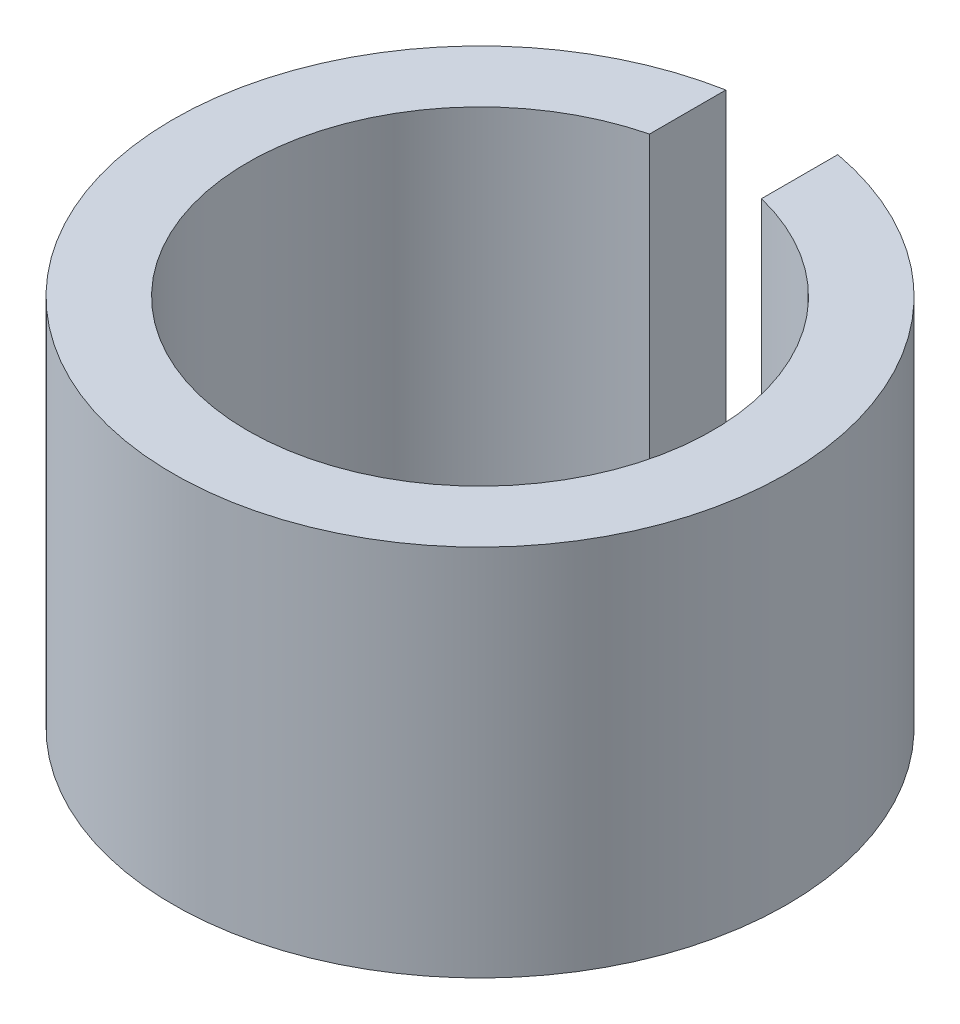
ISO-10303-21;
HEADER;
FILE_DESCRIPTION(('STEP AP214'),'2;1');
FILE_NAME('part.step','',(''),(''),'','','');
FILE_SCHEMA(('AUTOMOTIVE_DESIGN { 1 0 10303 214 1 1 1 1 }'));
ENDSEC;
DATA;
#1=APPLICATION_CONTEXT('core data for automotive mechanical design processes');
#2=APPLICATION_PROTOCOL_DEFINITION('international standard','automotive_design',2000,#1);
#3=PRODUCT_CONTEXT('',#1,'mechanical');
#4=PRODUCT('Part','Part','',(#3));
#5=PRODUCT_RELATED_PRODUCT_CATEGORY('part','',(#4));
#6=PRODUCT_DEFINITION_FORMATION('','',#4);
#7=PRODUCT_DEFINITION_CONTEXT('part definition',#1,'design');
#8=PRODUCT_DEFINITION('design','',#6,#7);
#9=PRODUCT_DEFINITION_SHAPE('','',#8);
#10=(LENGTH_UNIT() NAMED_UNIT(*) SI_UNIT(.MILLI.,.METRE.));
#11=(NAMED_UNIT(*) PLANE_ANGLE_UNIT() SI_UNIT($,.RADIAN.));
#12=(NAMED_UNIT(*) SI_UNIT($,.STERADIAN.) SOLID_ANGLE_UNIT());
#13=UNCERTAINTY_MEASURE_WITH_UNIT(LENGTH_MEASURE(1.E-05),#10,'distance_accuracy_value','');
#14=(GEOMETRIC_REPRESENTATION_CONTEXT(3) GLOBAL_UNCERTAINTY_ASSIGNED_CONTEXT((#13)) GLOBAL_UNIT_ASSIGNED_CONTEXT((#10,
#11,#12)) REPRESENTATION_CONTEXT('',''));
#15=CARTESIAN_POINT('',(0.,0.,0.));
#16=DIRECTION('',(0.,0.,1.));
#17=DIRECTION('',(1.,0.,0.));
#18=AXIS2_PLACEMENT_3D('',#15,#16,#17);
#19=CARTESIAN_POINT('',(0.,5.08,0.));
#20=DIRECTION('',(0.,-1.,0.));
#21=DIRECTION('',(0.,0.,-1.));
#22=AXIS2_PLACEMENT_3D('',#19,#20,#21);
#23=CYLINDRICAL_SURFACE('',#22,4.1783);
#24=CARTESIAN_POINT('',(0.,0.,0.));
#25=DIRECTION('',(0.,1.,0.));
#26=DIRECTION('',(0.,0.,1.));
#27=AXIS2_PLACEMENT_3D('',#24,#25,#26);
#28=CIRCLE('',#27,4.1783);
#29=CARTESIAN_POINT('',(-0.762,0.,-4.10822916717167));
#30=VERTEX_POINT('',#29);
#31=CARTESIAN_POINT('',(0.762,0.,-4.10822916717167));
#32=VERTEX_POINT('',#31);
#33=EDGE_CURVE('E107',#30,#32,#28,.T.);
#34=ORIENTED_EDGE('',*,*,#33,.T.);
#35=DIRECTION('',(0.,-1.,0.));
#36=VECTOR('',#35,1.);
#37=CARTESIAN_POINT('',(0.762,5.08,-4.10822916717167));
#38=LINE('',#37,#36);
#39=CARTESIAN_POINT('',(0.762,5.08,-4.10822916717167));
#40=VERTEX_POINT('',#39);
#41=EDGE_CURVE('E11',#40,#32,#38,.T.);
#42=ORIENTED_EDGE('',*,*,#41,.F.);
#43=CARTESIAN_POINT('',(0.,5.08,0.));
#44=DIRECTION('',(0.,1.,0.));
#45=DIRECTION('',(0.,0.,1.));
#46=AXIS2_PLACEMENT_3D('',#43,#44,#45);
#47=CIRCLE('',#46,4.1783);
#48=CARTESIAN_POINT('',(-0.762,5.08,-4.10822916717167));
#49=VERTEX_POINT('',#48);
#50=EDGE_CURVE('E91',#49,#40,#47,.T.);
#51=ORIENTED_EDGE('',*,*,#50,.F.);
#52=DIRECTION('',(0.,-1.,0.));
#53=VECTOR('',#52,1.);
#54=CARTESIAN_POINT('',(-0.762,5.08,-4.10822916717167));
#55=LINE('',#54,#53);
#56=EDGE_CURVE('E103',#49,#30,#55,.T.);
#57=ORIENTED_EDGE('',*,*,#56,.T.);
#58=EDGE_LOOP('',(#34,#42,#51,#57));
#59=FACE_BOUND('',#58,.T.);
#60=ADVANCED_FACE('F39',(#59),#23,.T.);
#61=CARTESIAN_POINT('',(0.762,5.08,-4.10822916717167));
#62=DIRECTION('',(1.,0.,0.));
#63=DIRECTION('',(0.,0.,-1.));
#64=AXIS2_PLACEMENT_3D('',#61,#62,#63);
#65=PLANE('',#64);
#66=DIRECTION('',(0.,0.,1.));
#67=VECTOR('',#66,1.);
#68=CARTESIAN_POINT('',(0.762,0.,-4.10822916717167));
#69=LINE('',#68,#67);
#70=CARTESIAN_POINT('',(0.762000000000001,0.,-3.0691199536675));
#71=VERTEX_POINT('',#70);
#72=EDGE_CURVE('E96',#32,#71,#69,.T.);
#73=ORIENTED_EDGE('',*,*,#72,.T.);
#74=DIRECTION('',(0.,-1.,0.));
#75=VECTOR('',#74,1.);
#76=CARTESIAN_POINT('',(0.762000000000001,5.08,-3.0691199536675));
#77=LINE('',#76,#75);
#78=CARTESIAN_POINT('',(0.762000000000001,5.08,-3.0691199536675));
#79=VERTEX_POINT('',#78);
#80=EDGE_CURVE('E48',#79,#71,#77,.T.);
#81=ORIENTED_EDGE('',*,*,#80,.F.);
#82=DIRECTION('',(0.,0.,1.));
#83=VECTOR('',#82,1.);
#84=CARTESIAN_POINT('',(0.762,5.08,-4.10822916717167));
#85=LINE('',#84,#83);
#86=EDGE_CURVE('E86',#40,#79,#85,.T.);
#87=ORIENTED_EDGE('',*,*,#86,.F.);
#88=ORIENTED_EDGE('',*,*,#41,.T.);
#89=EDGE_LOOP('',(#73,#81,#87,#88));
#90=FACE_BOUND('',#89,.T.);
#91=ADVANCED_FACE('F95',(#90),#65,.F.);
#92=CARTESIAN_POINT('',(0.,5.08,0.));
#93=DIRECTION('',(0.,-1.,0.));
#94=DIRECTION('',(0.,0.,-1.));
#95=AXIS2_PLACEMENT_3D('',#92,#93,#94);
#96=CYLINDRICAL_SURFACE('',#95,3.1623);
#97=CARTESIAN_POINT('',(0.,0.,0.));
#98=DIRECTION('',(0.,-1.,0.));
#99=DIRECTION('',(0.,0.,1.));
#100=AXIS2_PLACEMENT_3D('',#97,#98,#99);
#101=CIRCLE('',#100,3.1623);
#102=CARTESIAN_POINT('',(-0.762,0.,-3.0691199536675));
#103=VERTEX_POINT('',#102);
#104=EDGE_CURVE('E73',#71,#103,#101,.T.);
#105=ORIENTED_EDGE('',*,*,#104,.T.);
#106=DIRECTION('',(0.,-1.,0.));
#107=VECTOR('',#106,1.);
#108=CARTESIAN_POINT('',(-0.762,5.08,-3.0691199536675));
#109=LINE('',#108,#107);
#110=CARTESIAN_POINT('',(-0.762,5.08,-3.0691199536675));
#111=VERTEX_POINT('',#110);
#112=EDGE_CURVE('E98',#111,#103,#109,.T.);
#113=ORIENTED_EDGE('',*,*,#112,.F.);
#114=CARTESIAN_POINT('',(0.,5.08,0.));
#115=DIRECTION('',(0.,-1.,0.));
#116=DIRECTION('',(0.,0.,1.));
#117=AXIS2_PLACEMENT_3D('',#114,#115,#116);
#118=CIRCLE('',#117,3.1623);
#119=EDGE_CURVE('E89',#79,#111,#118,.T.);
#120=ORIENTED_EDGE('',*,*,#119,.F.);
#121=ORIENTED_EDGE('',*,*,#80,.T.);
#122=EDGE_LOOP('',(#105,#113,#120,#121));
#123=FACE_BOUND('',#122,.T.);
#124=ADVANCED_FACE('F99',(#123),#96,.F.);
#125=CARTESIAN_POINT('',(-0.762,5.08,-4.10822916717167));
#126=DIRECTION('',(-1.,0.,0.));
#127=DIRECTION('',(0.,0.,1.));
#128=AXIS2_PLACEMENT_3D('',#125,#126,#127);
#129=PLANE('',#128);
#130=DIRECTION('',(0.,0.,-1.));
#131=VECTOR('',#130,1.);
#132=CARTESIAN_POINT('',(-0.762,0.,-4.10822916717167));
#133=LINE('',#132,#131);
#134=EDGE_CURVE('E79',#103,#30,#133,.T.);
#135=ORIENTED_EDGE('',*,*,#134,.T.);
#136=ORIENTED_EDGE('',*,*,#56,.F.);
#137=DIRECTION('',(0.,0.,-1.));
#138=VECTOR('',#137,1.);
#139=CARTESIAN_POINT('',(-0.762,5.08,-4.10822916717167));
#140=LINE('',#139,#138);
#141=EDGE_CURVE('E56',#111,#49,#140,.T.);
#142=ORIENTED_EDGE('',*,*,#141,.F.);
#143=ORIENTED_EDGE('',*,*,#112,.T.);
#144=EDGE_LOOP('',(#135,#136,#142,#143));
#145=FACE_BOUND('',#144,.T.);
#146=ADVANCED_FACE('F120',(#145),#129,.F.);
#147=CARTESIAN_POINT('',(0.,5.08,0.));
#148=DIRECTION('',(0.,1.,0.));
#149=DIRECTION('',(0.,0.,1.));
#150=AXIS2_PLACEMENT_3D('',#147,#148,#149);
#151=PLANE('',#150);
#152=ORIENTED_EDGE('',*,*,#50,.T.);
#153=ORIENTED_EDGE('',*,*,#86,.T.);
#154=ORIENTED_EDGE('',*,*,#119,.T.);
#155=ORIENTED_EDGE('',*,*,#141,.T.);
#156=EDGE_LOOP('',(#152,#153,#154,#155));
#157=FACE_BOUND('',#156,.T.);
#158=ADVANCED_FACE('F87',(#157),#151,.T.);
#159=CARTESIAN_POINT('',(0.,0.,0.));
#160=DIRECTION('',(0.,1.,0.));
#161=DIRECTION('',(0.,0.,1.));
#162=AXIS2_PLACEMENT_3D('',#159,#160,#161);
#163=PLANE('',#162);
#164=ORIENTED_EDGE('',*,*,#33,.F.);
#165=ORIENTED_EDGE('',*,*,#134,.F.);
#166=ORIENTED_EDGE('',*,*,#104,.F.);
#167=ORIENTED_EDGE('',*,*,#72,.F.);
#168=EDGE_LOOP('',(#164,#165,#166,#167));
#169=FACE_BOUND('',#168,.T.);
#170=ADVANCED_FACE('F123',(#169),#163,.F.);
#171=CLOSED_SHELL('',(#60,#91,#124,#146,#158,#170));
#172=MANIFOLD_SOLID_BREP('B2',#171);
#173=ADVANCED_BREP_SHAPE_REPRESENTATION('',(#18,#172),#14);
#174=SHAPE_DEFINITION_REPRESENTATION(#9,#173);
ENDSEC;
END-ISO-10303-21;
